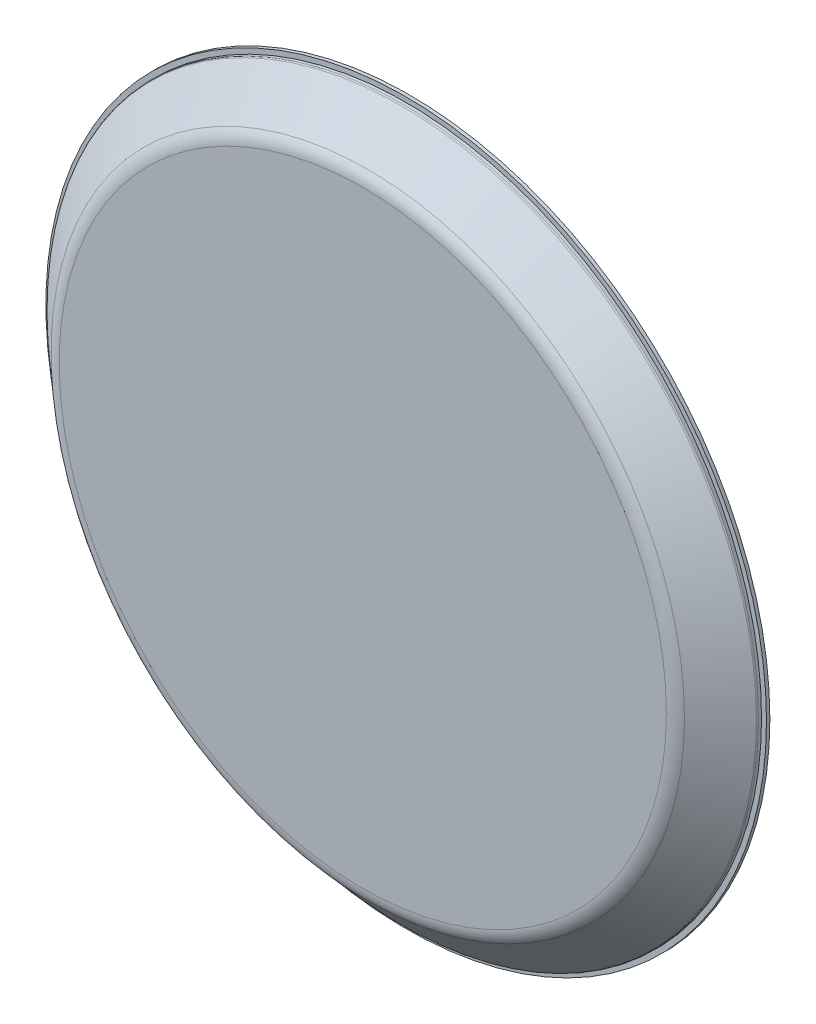
ISO-10303-21;
HEADER;
FILE_DESCRIPTION(('STEP AP214'),'2;1');
FILE_NAME('part.step','',(''),(''),'','','');
FILE_SCHEMA(('AUTOMOTIVE_DESIGN { 1 0 10303 214 1 1 1 1 }'));
ENDSEC;
DATA;
#1=APPLICATION_CONTEXT('core data for automotive mechanical design processes');
#2=APPLICATION_PROTOCOL_DEFINITION('international standard','automotive_design',2000,#1);
#3=PRODUCT_CONTEXT('',#1,'mechanical');
#4=PRODUCT('Part','Part','',(#3));
#5=PRODUCT_RELATED_PRODUCT_CATEGORY('part','',(#4));
#6=PRODUCT_DEFINITION_FORMATION('','',#4);
#7=PRODUCT_DEFINITION_CONTEXT('part definition',#1,'design');
#8=PRODUCT_DEFINITION('design','',#6,#7);
#9=PRODUCT_DEFINITION_SHAPE('','',#8);
#10=(LENGTH_UNIT() NAMED_UNIT(*) SI_UNIT(.MILLI.,.METRE.));
#11=(NAMED_UNIT(*) PLANE_ANGLE_UNIT() SI_UNIT($,.RADIAN.));
#12=(NAMED_UNIT(*) SI_UNIT($,.STERADIAN.) SOLID_ANGLE_UNIT());
#13=UNCERTAINTY_MEASURE_WITH_UNIT(LENGTH_MEASURE(1.E-05),#10,'distance_accuracy_value','');
#14=(GEOMETRIC_REPRESENTATION_CONTEXT(3) GLOBAL_UNCERTAINTY_ASSIGNED_CONTEXT((#13)) GLOBAL_UNIT_ASSIGNED_CONTEXT((#10,
#11,#12)) REPRESENTATION_CONTEXT('',''));
#15=CARTESIAN_POINT('',(0.,0.,0.));
#16=DIRECTION('',(0.,0.,1.));
#17=DIRECTION('',(1.,0.,0.));
#18=AXIS2_PLACEMENT_3D('',#15,#16,#17);
#19=CARTESIAN_POINT('',(0.,18.2536498750077,-0.368480901052237));
#20=DIRECTION('',(0.,0.,1.));
#21=DIRECTION('',(1.,0.,0.));
#22=AXIS2_PLACEMENT_3D('',#19,#20,#21);
#23=PLANE('',#22);
#24=CARTESIAN_POINT('',(0.,0.,-0.368480901052237));
#25=DIRECTION('',(0.,0.,1.));
#26=DIRECTION('',(1.,0.,0.));
#27=AXIS2_PLACEMENT_3D('',#24,#25,#26);
#28=CIRCLE('',#27,18.2536498750077);
#29=CARTESIAN_POINT('',(18.2536498750077,0.,-0.368480901052237));
#30=VERTEX_POINT('',#29);
#31=EDGE_CURVE('E68',#30,#30,#28,.T.);
#32=ORIENTED_EDGE('',*,*,#31,.F.);
#33=EDGE_LOOP('',(#32));
#34=FACE_BOUND('',#33,.T.);
#35=CARTESIAN_POINT('',(0.,0.,-0.368480901052237));
#36=DIRECTION('',(0.,0.,1.));
#37=DIRECTION('',(1.,0.,0.));
#38=AXIS2_PLACEMENT_3D('',#35,#36,#37);
#39=CIRCLE('',#38,17.5641984715067);
#40=CARTESIAN_POINT('',(17.5641984715067,0.,-0.368480901052237));
#41=VERTEX_POINT('',#40);
#42=EDGE_CURVE('E10',#41,#41,#39,.T.);
#43=ORIENTED_EDGE('',*,*,#42,.T.);
#44=EDGE_LOOP('',(#43));
#45=FACE_BOUND('',#44,.T.);
#46=ADVANCED_FACE('F31',(#34,#45),#23,.F.);
#47=CARTESIAN_POINT('',(0.,0.,-0.268480901052237));
#48=DIRECTION('',(0.,0.,1.));
#49=DIRECTION('',(1.,0.,0.));
#50=AXIS2_PLACEMENT_3D('',#47,#48,#49);
#51=TOROIDAL_SURFACE('',#50,17.5641984715067,0.0999999999999997);
#52=ORIENTED_EDGE('',*,*,#42,.F.);
#53=EDGE_LOOP('',(#52));
#54=FACE_BOUND('',#53,.T.);
#55=CARTESIAN_POINT('',(0.,0.,-0.343090579567605));
#56=DIRECTION('',(0.,0.,1.));
#57=DIRECTION('',(1.,0.,0.));
#58=AXIS2_PLACEMENT_3D('',#55,#56,#57);
#59=CIRCLE('',#58,17.4976147206974);
#60=CARTESIAN_POINT('',(17.4976147206974,0.,-0.343090579567605));
#61=VERTEX_POINT('',#60);
#62=EDGE_CURVE('E37',#61,#61,#59,.T.);
#63=ORIENTED_EDGE('',*,*,#62,.T.);
#64=EDGE_LOOP('',(#63));
#65=FACE_BOUND('',#64,.T.);
#66=ADVANCED_FACE('F75',(#54,#65),#51,.T.);
#67=CARTESIAN_POINT('',(0.,0.,1.29843871406147));
#68=DIRECTION('',(0.,0.,-1.));
#69=DIRECTION('',(-1.,0.,0.));
#70=AXIS2_PLACEMENT_3D('',#67,#68,#69);
#71=CONICAL_SURFACE('',#70,15.6582173995399,0.842180550877895);
#72=ORIENTED_EDGE('',*,*,#62,.F.);
#73=EDGE_LOOP('',(#72));
#74=FACE_BOUND('',#73,.T.);
#75=CARTESIAN_POINT('',(0.,0.,1.29843871406147));
#76=DIRECTION('',(0.,0.,1.));
#77=DIRECTION('',(1.,0.,0.));
#78=AXIS2_PLACEMENT_3D('',#75,#76,#77);
#79=CIRCLE('',#78,15.6582173995399);
#80=CARTESIAN_POINT('',(15.6582173995399,0.,1.29843871406147));
#81=VERTEX_POINT('',#80);
#82=EDGE_CURVE('E41',#81,#81,#79,.T.);
#83=ORIENTED_EDGE('',*,*,#82,.T.);
#84=EDGE_LOOP('',(#83));
#85=FACE_BOUND('',#84,.T.);
#86=ADVANCED_FACE('F79',(#74,#85),#71,.F.);
#87=CARTESIAN_POINT('',(0.,0.,1.));
#88=DIRECTION('',(0.,0.,1.));
#89=DIRECTION('',(1.,0.,0.));
#90=AXIS2_PLACEMENT_3D('',#87,#88,#89);
#91=TOROIDAL_SURFACE('',#90,15.3918823963027,0.4);
#92=ORIENTED_EDGE('',*,*,#82,.F.);
#93=EDGE_LOOP('',(#92));
#94=FACE_BOUND('',#93,.T.);
#95=CARTESIAN_POINT('',(0.,0.,1.4));
#96=DIRECTION('',(0.,0.,1.));
#97=DIRECTION('',(1.,0.,0.));
#98=AXIS2_PLACEMENT_3D('',#95,#96,#97);
#99=CIRCLE('',#98,15.3918823963027);
#100=CARTESIAN_POINT('',(15.3918823963027,0.,1.4));
#101=VERTEX_POINT('',#100);
#102=EDGE_CURVE('E45',#101,#101,#99,.T.);
#103=ORIENTED_EDGE('',*,*,#102,.T.);
#104=EDGE_LOOP('',(#103));
#105=FACE_BOUND('',#104,.T.);
#106=ADVANCED_FACE('F84',(#94,#105),#91,.F.);
#107=CARTESIAN_POINT('',(0.,15.3918823963027,1.4));
#108=DIRECTION('',(0.,0.,1.));
#109=DIRECTION('',(1.,0.,0.));
#110=AXIS2_PLACEMENT_3D('',#107,#108,#109);
#111=PLANE('',#110);
#112=ORIENTED_EDGE('',*,*,#102,.F.);
#113=EDGE_LOOP('',(#112));
#114=FACE_BOUND('',#113,.T.);
#115=ADVANCED_FACE('F90',(#114),#111,.F.);
#116=CARTESIAN_POINT('',(0.,0.,2.));
#117=DIRECTION('',(0.,0.,-1.));
#118=DIRECTION('',(-1.,0.,0.));
#119=AXIS2_PLACEMENT_3D('',#116,#117,#118);
#120=PLANE('',#119);
#121=CARTESIAN_POINT('',(0.,0.,2.));
#122=DIRECTION('',(0.,0.,1.));
#123=DIRECTION('',(1.,0.,0.));
#124=AXIS2_PLACEMENT_3D('',#121,#122,#123);
#125=CIRCLE('',#124,15.37759323569);
#126=CARTESIAN_POINT('',(15.37759323569,0.,2.));
#127=VERTEX_POINT('',#126);
#128=EDGE_CURVE('E50',#127,#127,#125,.T.);
#129=ORIENTED_EDGE('',*,*,#128,.T.);
#130=EDGE_LOOP('',(#129));
#131=FACE_BOUND('',#130,.T.);
#132=ADVANCED_FACE('F94',(#131),#120,.F.);
#133=CARTESIAN_POINT('',(0.,0.,1.));
#134=DIRECTION('',(0.,0.,1.));
#135=DIRECTION('',(1.,0.,0.));
#136=AXIS2_PLACEMENT_3D('',#133,#134,#135);
#137=TOROIDAL_SURFACE('',#136,15.37759323569,1.);
#138=ORIENTED_EDGE('',*,*,#128,.F.);
#139=EDGE_LOOP('',(#138));
#140=FACE_BOUND('',#139,.T.);
#141=CARTESIAN_POINT('',(0.,0.,1.74609678515368));
#142=DIRECTION('',(0.,0.,1.));
#143=DIRECTION('',(1.,0.,0.));
#144=AXIS2_PLACEMENT_3D('',#141,#142,#143);
#145=CIRCLE('',#144,16.0434307437829);
#146=CARTESIAN_POINT('',(16.0434307437829,0.,1.74609678515368));
#147=VERTEX_POINT('',#146);
#148=EDGE_CURVE('E53',#147,#147,#145,.T.);
#149=ORIENTED_EDGE('',*,*,#148,.T.);
#150=EDGE_LOOP('',(#149));
#151=FACE_BOUND('',#150,.T.);
#152=ADVANCED_FACE('F98',(#140,#151),#137,.T.);
#153=CARTESIAN_POINT('',(0.,0.,0.0296501132316662));
#154=DIRECTION('',(0.,0.,-1.));
#155=DIRECTION('',(-1.,0.,0.));
#156=AXIS2_PLACEMENT_3D('',#153,#154,#155);
#157=CONICAL_SURFACE('',#156,17.9667758966818,0.842180550877895);
#158=ORIENTED_EDGE('',*,*,#148,.F.);
#159=EDGE_LOOP('',(#158));
#160=FACE_BOUND('',#159,.T.);
#161=CARTESIAN_POINT('',(0.,0.,0.0296501132316662));
#162=DIRECTION('',(0.,0.,1.));
#163=DIRECTION('',(1.,0.,0.));
#164=AXIS2_PLACEMENT_3D('',#161,#162,#163);
#165=CIRCLE('',#164,17.9667758966818);
#166=CARTESIAN_POINT('',(17.9667758966818,0.,0.0296501132316662));
#167=VERTEX_POINT('',#166);
#168=EDGE_CURVE('E56',#167,#167,#165,.T.);
#169=ORIENTED_EDGE('',*,*,#168,.T.);
#170=EDGE_LOOP('',(#169));
#171=FACE_BOUND('',#170,.T.);
#172=ADVANCED_FACE('F102',(#160,#171),#157,.T.);
#173=CARTESIAN_POINT('',(0.,0.,-0.0449595652837015));
#174=DIRECTION('',(0.,0.,1.));
#175=DIRECTION('',(1.,0.,0.));
#176=AXIS2_PLACEMENT_3D('',#173,#174,#175);
#177=TOROIDAL_SURFACE('',#176,17.9001921458725,0.0999999999999998);
#178=ORIENTED_EDGE('',*,*,#168,.F.);
#179=EDGE_LOOP('',(#178));
#180=FACE_BOUND('',#179,.T.);
#181=CARTESIAN_POINT('',(0.,0.,-0.0445301436048477));
#182=DIRECTION('',(0.,0.,1.));
#183=DIRECTION('',(1.,0.,0.));
#184=AXIS2_PLACEMENT_3D('',#181,#182,#183);
#185=CIRCLE('',#184,18.0001912238534);
#186=CARTESIAN_POINT('',(18.0001912238534,0.,-0.0445301436048477));
#187=VERTEX_POINT('',#186);
#188=EDGE_CURVE('E59',#187,#187,#185,.T.);
#189=ORIENTED_EDGE('',*,*,#188,.T.);
#190=EDGE_LOOP('',(#189));
#191=FACE_BOUND('',#190,.T.);
#192=ADVANCED_FACE('F106',(#180,#191),#177,.T.);
#193=CARTESIAN_POINT('',(0.,0.,-0.199998155962271));
#194=DIRECTION('',(0.,0.,-1.));
#195=DIRECTION('',(-1.,0.,0.));
#196=AXIS2_PLACEMENT_3D('',#193,#194,#195);
#197=CONICAL_SURFACE('',#196,18.0008588433577,0.00429422998642117);
#198=ORIENTED_EDGE('',*,*,#188,.F.);
#199=EDGE_LOOP('',(#198));
#200=FACE_BOUND('',#199,.T.);
#201=CARTESIAN_POINT('',(0.,0.,-0.199998155962271));
#202=DIRECTION('',(0.,0.,1.));
#203=DIRECTION('',(1.,0.,0.));
#204=AXIS2_PLACEMENT_3D('',#201,#202,#203);
#205=CIRCLE('',#204,18.0008588433577);
#206=CARTESIAN_POINT('',(18.0008588433577,0.,-0.199998155962271));
#207=VERTEX_POINT('',#206);
#208=EDGE_CURVE('E62',#207,#207,#205,.T.);
#209=ORIENTED_EDGE('',*,*,#208,.T.);
#210=EDGE_LOOP('',(#209));
#211=FACE_BOUND('',#210,.T.);
#212=ADVANCED_FACE('F110',(#200,#211),#197,.T.);
#213=CARTESIAN_POINT('',(0.,18.0008588433577,-0.19999815596227));
#214=DIRECTION('',(0.,0.,-1.));
#215=DIRECTION('',(-1.,0.,0.));
#216=AXIS2_PLACEMENT_3D('',#213,#214,#215);
#217=PLANE('',#216);
#218=ORIENTED_EDGE('',*,*,#208,.F.);
#219=EDGE_LOOP('',(#218));
#220=FACE_BOUND('',#219,.T.);
#221=CARTESIAN_POINT('',(0.,0.,-0.199998155962271));
#222=DIRECTION('',(0.,0.,1.));
#223=DIRECTION('',(1.,0.,0.));
#224=AXIS2_PLACEMENT_3D('',#221,#222,#223);
#225=CIRCLE('',#224,18.2508588433577);
#226=CARTESIAN_POINT('',(18.2508588433577,0.,-0.199998155962271));
#227=VERTEX_POINT('',#226);
#228=EDGE_CURVE('E65',#227,#227,#225,.T.);
#229=ORIENTED_EDGE('',*,*,#228,.T.);
#230=EDGE_LOOP('',(#229));
#231=FACE_BOUND('',#230,.T.);
#232=ADVANCED_FACE('F114',(#220,#231),#217,.F.);
#233=CARTESIAN_POINT('',(0.,0.,-0.368480901052237));
#234=DIRECTION('',(0.,0.,-1.));
#235=DIRECTION('',(-1.,0.,0.));
#236=AXIS2_PLACEMENT_3D('',#233,#234,#235);
#237=CONICAL_SURFACE('',#236,18.2536498750077,0.016564167350286);
#238=ORIENTED_EDGE('',*,*,#228,.F.);
#239=EDGE_LOOP('',(#238));
#240=FACE_BOUND('',#239,.T.);
#241=ORIENTED_EDGE('',*,*,#31,.T.);
#242=EDGE_LOOP('',(#241));
#243=FACE_BOUND('',#242,.T.);
#244=ADVANCED_FACE('F72',(#240,#243),#237,.T.);
#245=CLOSED_SHELL('',(#46,#66,#86,#106,#115,#132,#152,#172,#192,#212,#232,#244));
#246=MANIFOLD_SOLID_BREP('B2',#245);
#247=ADVANCED_BREP_SHAPE_REPRESENTATION('',(#18,#246),#14);
#248=SHAPE_DEFINITION_REPRESENTATION(#9,#247);
ENDSEC;
END-ISO-10303-21;
